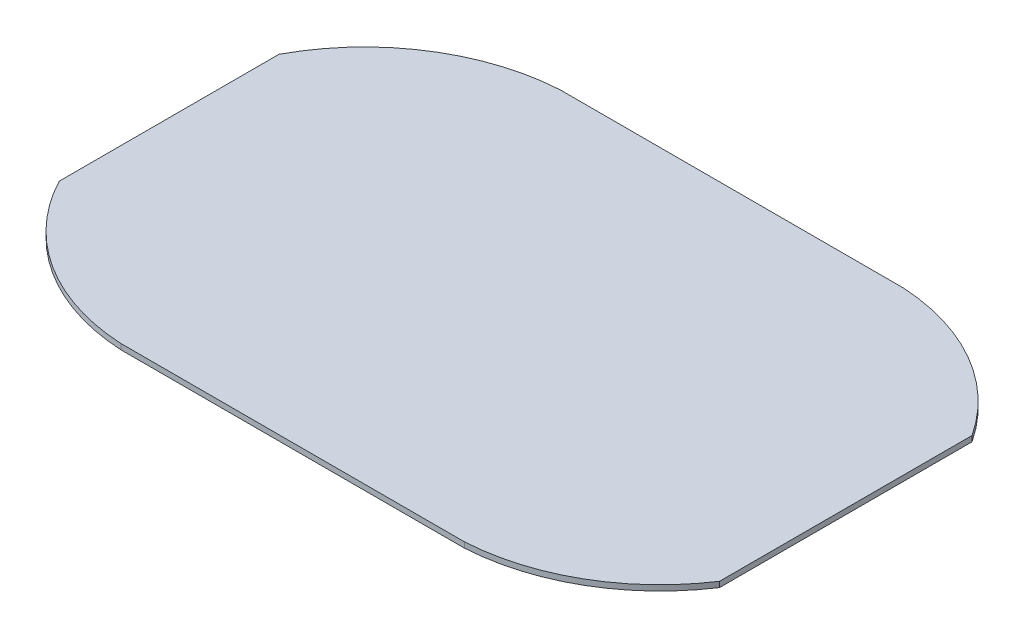
ISO-10303-21;
HEADER;
FILE_DESCRIPTION(('STEP AP214'),'2;1');
FILE_NAME('part.step','',(''),(''),'','','');
FILE_SCHEMA(('AUTOMOTIVE_DESIGN { 1 0 10303 214 1 1 1 1 }'));
ENDSEC;
DATA;
#1=APPLICATION_CONTEXT('core data for automotive mechanical design processes');
#2=APPLICATION_PROTOCOL_DEFINITION('international standard','automotive_design',2000,#1);
#3=PRODUCT_CONTEXT('',#1,'mechanical');
#4=PRODUCT('Part','Part','',(#3));
#5=PRODUCT_RELATED_PRODUCT_CATEGORY('part','',(#4));
#6=PRODUCT_DEFINITION_FORMATION('','',#4);
#7=PRODUCT_DEFINITION_CONTEXT('part definition',#1,'design');
#8=PRODUCT_DEFINITION('design','',#6,#7);
#9=PRODUCT_DEFINITION_SHAPE('','',#8);
#10=(LENGTH_UNIT() NAMED_UNIT(*) SI_UNIT(.MILLI.,.METRE.));
#11=(NAMED_UNIT(*) PLANE_ANGLE_UNIT() SI_UNIT($,.RADIAN.));
#12=(NAMED_UNIT(*) SI_UNIT($,.STERADIAN.) SOLID_ANGLE_UNIT());
#13=UNCERTAINTY_MEASURE_WITH_UNIT(LENGTH_MEASURE(1.E-05),#10,'distance_accuracy_value','');
#14=(GEOMETRIC_REPRESENTATION_CONTEXT(3) GLOBAL_UNCERTAINTY_ASSIGNED_CONTEXT((#13)) GLOBAL_UNIT_ASSIGNED_CONTEXT((#10,
#11,#12)) REPRESENTATION_CONTEXT('',''));
#15=CARTESIAN_POINT('',(0.,0.,0.));
#16=DIRECTION('',(0.,0.,1.));
#17=DIRECTION('',(1.,0.,0.));
#18=AXIS2_PLACEMENT_3D('',#15,#16,#17);
#19=CARTESIAN_POINT('',(-125.,2.,-80.));
#20=DIRECTION('',(0.,0.,1.));
#21=DIRECTION('',(1.,0.,0.));
#22=AXIS2_PLACEMENT_3D('',#19,#20,#21);
#23=PLANE('',#22);
#24=DIRECTION('',(-1.,0.,0.));
#25=VECTOR('',#24,1.);
#26=CARTESIAN_POINT('',(-125.,2.,-80.));
#27=LINE('',#26,#25);
#28=CARTESIAN_POINT('',(62.5,2.,-80.));
#29=VERTEX_POINT('',#28);
#30=CARTESIAN_POINT('',(-62.5,2.,-80.));
#31=VERTEX_POINT('',#30);
#32=EDGE_CURVE('E137',#29,#31,#27,.T.);
#33=ORIENTED_EDGE('',*,*,#32,.F.);
#34=DIRECTION('',(0.,1.,0.));
#35=VECTOR('',#34,1.);
#36=CARTESIAN_POINT('',(62.5,-48.,-80.));
#37=LINE('',#36,#35);
#38=CARTESIAN_POINT('',(62.5,0.,-80.));
#39=VERTEX_POINT('',#38);
#40=EDGE_CURVE('E116',#39,#29,#37,.T.);
#41=ORIENTED_EDGE('',*,*,#40,.F.);
#42=DIRECTION('',(-1.,0.,0.));
#43=VECTOR('',#42,1.);
#44=CARTESIAN_POINT('',(-125.,0.,-80.));
#45=LINE('',#44,#43);
#46=CARTESIAN_POINT('',(-62.5,0.,-80.));
#47=VERTEX_POINT('',#46);
#48=EDGE_CURVE('E136',#39,#47,#45,.T.);
#49=ORIENTED_EDGE('',*,*,#48,.T.);
#50=DIRECTION('',(0.,1.,0.));
#51=VECTOR('',#50,1.);
#52=CARTESIAN_POINT('',(-62.5,-48.,-80.));
#53=LINE('',#52,#51);
#54=EDGE_CURVE('E58',#47,#31,#53,.T.);
#55=ORIENTED_EDGE('',*,*,#54,.T.);
#56=EDGE_LOOP('',(#33,#41,#49,#55));
#57=FACE_BOUND('',#56,.T.);
#58=ADVANCED_FACE('F37',(#57),#23,.F.);
#59=CARTESIAN_POINT('',(-125.,2.,80.));
#60=DIRECTION('',(1.,0.,0.));
#61=DIRECTION('',(0.,0.,-1.));
#62=AXIS2_PLACEMENT_3D('',#59,#60,#61);
#63=PLANE('',#62);
#64=DIRECTION('',(0.,0.,1.));
#65=VECTOR('',#64,1.);
#66=CARTESIAN_POINT('',(-125.,0.,80.));
#67=LINE('',#66,#65);
#68=CARTESIAN_POINT('',(-125.,0.,-40.));
#69=VERTEX_POINT('',#68);
#70=CARTESIAN_POINT('',(-125.,0.,40.));
#71=VERTEX_POINT('',#70);
#72=EDGE_CURVE('E148',#69,#71,#67,.T.);
#73=ORIENTED_EDGE('',*,*,#72,.T.);
#74=DIRECTION('',(0.,1.,0.));
#75=VECTOR('',#74,1.);
#76=CARTESIAN_POINT('',(-125.,-48.,40.));
#77=LINE('',#76,#75);
#78=CARTESIAN_POINT('',(-125.,2.,40.));
#79=VERTEX_POINT('',#78);
#80=EDGE_CURVE('E124',#71,#79,#77,.T.);
#81=ORIENTED_EDGE('',*,*,#80,.T.);
#82=DIRECTION('',(0.,0.,1.));
#83=VECTOR('',#82,1.);
#84=CARTESIAN_POINT('',(-125.,2.,80.));
#85=LINE('',#84,#83);
#86=CARTESIAN_POINT('',(-125.,2.,-40.));
#87=VERTEX_POINT('',#86);
#88=EDGE_CURVE('E139',#87,#79,#85,.T.);
#89=ORIENTED_EDGE('',*,*,#88,.F.);
#90=DIRECTION('',(0.,1.,0.));
#91=VECTOR('',#90,1.);
#92=CARTESIAN_POINT('',(-125.,-48.,-40.));
#93=LINE('',#92,#91);
#94=EDGE_CURVE('E118',#69,#87,#93,.T.);
#95=ORIENTED_EDGE('',*,*,#94,.F.);
#96=EDGE_LOOP('',(#73,#81,#89,#95));
#97=FACE_BOUND('',#96,.T.);
#98=ADVANCED_FACE('F176',(#97),#63,.F.);
#99=CARTESIAN_POINT('',(-125.,2.,80.));
#100=DIRECTION('',(0.,0.,-1.));
#101=DIRECTION('',(-1.,0.,0.));
#102=AXIS2_PLACEMENT_3D('',#99,#100,#101);
#103=PLANE('',#102);
#104=DIRECTION('',(1.,0.,0.));
#105=VECTOR('',#104,1.);
#106=CARTESIAN_POINT('',(-125.,2.,80.));
#107=LINE('',#106,#105);
#108=CARTESIAN_POINT('',(-62.5,2.,80.));
#109=VERTEX_POINT('',#108);
#110=CARTESIAN_POINT('',(62.5,2.,80.));
#111=VERTEX_POINT('',#110);
#112=EDGE_CURVE('E143',#109,#111,#107,.T.);
#113=ORIENTED_EDGE('',*,*,#112,.F.);
#114=DIRECTION('',(0.,1.,0.));
#115=VECTOR('',#114,1.);
#116=CARTESIAN_POINT('',(-62.5,-48.,80.));
#117=LINE('',#116,#115);
#118=CARTESIAN_POINT('',(-62.5,0.,80.));
#119=VERTEX_POINT('',#118);
#120=EDGE_CURVE('E127',#119,#109,#117,.T.);
#121=ORIENTED_EDGE('',*,*,#120,.F.);
#122=DIRECTION('',(1.,0.,0.));
#123=VECTOR('',#122,1.);
#124=CARTESIAN_POINT('',(-125.,0.,80.));
#125=LINE('',#124,#123);
#126=CARTESIAN_POINT('',(62.4999999999999,0.,80.));
#127=VERTEX_POINT('',#126);
#128=EDGE_CURVE('E140',#119,#127,#125,.T.);
#129=ORIENTED_EDGE('',*,*,#128,.T.);
#130=DIRECTION('',(0.,1.,0.));
#131=VECTOR('',#130,1.);
#132=CARTESIAN_POINT('',(62.5,-48.,80.));
#133=LINE('',#132,#131);
#134=EDGE_CURVE('E132',#127,#111,#133,.T.);
#135=ORIENTED_EDGE('',*,*,#134,.T.);
#136=EDGE_LOOP('',(#113,#121,#129,#135));
#137=FACE_BOUND('',#136,.T.);
#138=ADVANCED_FACE('F168',(#137),#103,.F.);
#139=CARTESIAN_POINT('',(0.,2.,0.));
#140=DIRECTION('',(0.,-1.,0.));
#141=DIRECTION('',(0.,0.,-1.));
#142=AXIS2_PLACEMENT_3D('',#139,#140,#141);
#143=PLANE('',#142);
#144=CARTESIAN_POINT('',(58.1140833411923,2.,4.31888022061296));
#145=DIRECTION('',(0.,-1.,0.));
#146=DIRECTION('',(0.,0.,-1.));
#147=AXIS2_PLACEMENT_3D('',#144,#145,#146);
#148=CIRCLE('',#147,75.80810086);
#149=CARTESIAN_POINT('',(121.447872965525,2.,45.9806042346371));
#150=VERTEX_POINT('',#149);
#151=EDGE_CURVE('E112',#150,#111,#148,.T.);
#152=ORIENTED_EDGE('',*,*,#151,.F.);
#153=DIRECTION('',(0.,0.,1.));
#154=VECTOR('',#153,1.);
#155=CARTESIAN_POINT('',(121.447872965525,2.,-76.7820441304263));
#156=LINE('',#155,#154);
#157=CARTESIAN_POINT('',(121.447872965525,2.,-45.9806042346371));
#158=VERTEX_POINT('',#157);
#159=EDGE_CURVE('E99',#158,#150,#156,.T.);
#160=ORIENTED_EDGE('',*,*,#159,.F.);
#161=CARTESIAN_POINT('',(58.1140833411923,2.,-4.31888022061296));
#162=DIRECTION('',(0.,-1.,0.));
#163=DIRECTION('',(0.,0.,-1.));
#164=AXIS2_PLACEMENT_3D('',#161,#162,#163);
#165=CIRCLE('',#164,75.80810086);
#166=EDGE_CURVE('E109',#29,#158,#165,.T.);
#167=ORIENTED_EDGE('',*,*,#166,.F.);
#168=ORIENTED_EDGE('',*,*,#32,.T.);
#169=CARTESIAN_POINT('',(-58.1140832773658,2.,-4.31888012088417));
#170=DIRECTION('',(0.,-1.,0.));
#171=DIRECTION('',(0.,0.,1.));
#172=AXIS2_PLACEMENT_3D('',#169,#170,#171);
#173=CIRCLE('',#172,75.8081009632545);
#174=EDGE_CURVE('E133',#87,#31,#173,.T.);
#175=ORIENTED_EDGE('',*,*,#174,.F.);
#176=ORIENTED_EDGE('',*,*,#88,.T.);
#177=CARTESIAN_POINT('',(-58.8595262680034,2.,5.48363479375528));
#178=DIRECTION('',(0.,-1.,0.));
#179=DIRECTION('',(0.,0.,-1.));
#180=AXIS2_PLACEMENT_3D('',#177,#178,#179);
#181=CIRCLE('',#180,74.6052393102776);
#182=EDGE_CURVE('E120',#109,#79,#181,.T.);
#183=ORIENTED_EDGE('',*,*,#182,.F.);
#184=ORIENTED_EDGE('',*,*,#112,.T.);
#185=EDGE_LOOP('',(#152,#160,#167,#168,#175,#176,#183,#184));
#186=FACE_BOUND('',#185,.T.);
#187=ADVANCED_FACE('F107',(#186),#143,.F.);
#188=CARTESIAN_POINT('',(0.,0.,0.));
#189=DIRECTION('',(0.,-1.,0.));
#190=DIRECTION('',(0.,0.,-1.));
#191=AXIS2_PLACEMENT_3D('',#188,#189,#190);
#192=PLANE('',#191);
#193=DIRECTION('',(0.,0.,-1.));
#194=VECTOR('',#193,1.);
#195=CARTESIAN_POINT('',(121.447872965525,0.,0.));
#196=LINE('',#195,#194);
#197=CARTESIAN_POINT('',(121.447872965525,0.,45.9806042346371));
#198=VERTEX_POINT('',#197);
#199=CARTESIAN_POINT('',(121.447872965525,0.,-45.9806042346371));
#200=VERTEX_POINT('',#199);
#201=EDGE_CURVE('E51',#198,#200,#196,.T.);
#202=ORIENTED_EDGE('',*,*,#201,.F.);
#203=CARTESIAN_POINT('',(58.1140833411923,0.,4.31888022061296));
#204=DIRECTION('',(0.,-1.,0.));
#205=DIRECTION('',(0.,0.,-1.));
#206=AXIS2_PLACEMENT_3D('',#203,#204,#205);
#207=CIRCLE('',#206,75.80810086);
#208=EDGE_CURVE('E145',#127,#198,#207,.F.);
#209=ORIENTED_EDGE('',*,*,#208,.F.);
#210=ORIENTED_EDGE('',*,*,#128,.F.);
#211=CARTESIAN_POINT('',(-58.8595262680034,0.,5.48363479375528));
#212=DIRECTION('',(0.,-1.,0.));
#213=DIRECTION('',(0.,0.,-1.));
#214=AXIS2_PLACEMENT_3D('',#211,#212,#213);
#215=CIRCLE('',#214,74.6052393102776);
#216=EDGE_CURVE('E44',#71,#119,#215,.F.);
#217=ORIENTED_EDGE('',*,*,#216,.F.);
#218=ORIENTED_EDGE('',*,*,#72,.F.);
#219=CARTESIAN_POINT('',(-58.1140832773658,0.,-4.31888012088417));
#220=DIRECTION('',(0.,-1.,0.));
#221=DIRECTION('',(0.,0.,-1.));
#222=AXIS2_PLACEMENT_3D('',#219,#220,#221);
#223=CIRCLE('',#222,75.8081009632545);
#224=EDGE_CURVE('E155',#47,#69,#223,.F.);
#225=ORIENTED_EDGE('',*,*,#224,.F.);
#226=ORIENTED_EDGE('',*,*,#48,.F.);
#227=CARTESIAN_POINT('',(58.1140833411923,0.,-4.31888022061296));
#228=DIRECTION('',(0.,-1.,0.));
#229=DIRECTION('',(0.,0.,-1.));
#230=AXIS2_PLACEMENT_3D('',#227,#228,#229);
#231=CIRCLE('',#230,75.80810086);
#232=EDGE_CURVE('E157',#200,#39,#231,.F.);
#233=ORIENTED_EDGE('',*,*,#232,.F.);
#234=EDGE_LOOP('',(#202,#209,#210,#217,#218,#225,#226,#233));
#235=FACE_BOUND('',#234,.T.);
#236=ADVANCED_FACE('F170',(#235),#192,.T.);
#237=CARTESIAN_POINT('',(58.1140833411923,-48.,4.31888022061296));
#238=DIRECTION('',(0.,1.,0.));
#239=DIRECTION('',(0.,0.,1.));
#240=AXIS2_PLACEMENT_3D('',#237,#238,#239);
#241=CYLINDRICAL_SURFACE('',#240,75.80810086);
#242=ORIENTED_EDGE('',*,*,#208,.T.);
#243=DIRECTION('',(0.,1.,0.));
#244=VECTOR('',#243,1.);
#245=CARTESIAN_POINT('',(121.447872965525,-48.,45.9806042346371));
#246=LINE('',#245,#244);
#247=EDGE_CURVE('E129',#198,#150,#246,.T.);
#248=ORIENTED_EDGE('',*,*,#247,.T.);
#249=ORIENTED_EDGE('',*,*,#151,.T.);
#250=ORIENTED_EDGE('',*,*,#134,.F.);
#251=EDGE_LOOP('',(#242,#248,#249,#250));
#252=FACE_BOUND('',#251,.T.);
#253=ADVANCED_FACE('F172',(#252),#241,.T.);
#254=CARTESIAN_POINT('',(-58.1140832773658,-48.,-4.31888012088417));
#255=DIRECTION('',(0.,1.,0.));
#256=DIRECTION('',(0.,0.,1.));
#257=AXIS2_PLACEMENT_3D('',#254,#255,#256);
#258=CYLINDRICAL_SURFACE('',#257,75.8081009632545);
#259=ORIENTED_EDGE('',*,*,#224,.T.);
#260=ORIENTED_EDGE('',*,*,#94,.T.);
#261=ORIENTED_EDGE('',*,*,#174,.T.);
#262=ORIENTED_EDGE('',*,*,#54,.F.);
#263=EDGE_LOOP('',(#259,#260,#261,#262));
#264=FACE_BOUND('',#263,.T.);
#265=ADVANCED_FACE('F183',(#264),#258,.T.);
#266=CARTESIAN_POINT('',(58.1140833411923,-48.,-4.31888022061296));
#267=DIRECTION('',(0.,1.,0.));
#268=DIRECTION('',(0.,0.,1.));
#269=AXIS2_PLACEMENT_3D('',#266,#267,#268);
#270=CYLINDRICAL_SURFACE('',#269,75.80810086);
#271=ORIENTED_EDGE('',*,*,#166,.T.);
#272=DIRECTION('',(0.,1.,0.));
#273=VECTOR('',#272,1.);
#274=CARTESIAN_POINT('',(121.447872965525,-48.,-45.9806042346371));
#275=LINE('',#274,#273);
#276=EDGE_CURVE('E11',#158,#200,#275,.F.);
#277=ORIENTED_EDGE('',*,*,#276,.T.);
#278=ORIENTED_EDGE('',*,*,#232,.T.);
#279=ORIENTED_EDGE('',*,*,#40,.T.);
#280=EDGE_LOOP('',(#271,#277,#278,#279));
#281=FACE_BOUND('',#280,.T.);
#282=ADVANCED_FACE('F114',(#281),#270,.T.);
#283=CARTESIAN_POINT('',(-58.8595262680034,-48.,5.48363479375528));
#284=DIRECTION('',(0.,1.,0.));
#285=DIRECTION('',(0.,0.,1.));
#286=AXIS2_PLACEMENT_3D('',#283,#284,#285);
#287=CYLINDRICAL_SURFACE('',#286,74.6052393102776);
#288=ORIENTED_EDGE('',*,*,#216,.T.);
#289=ORIENTED_EDGE('',*,*,#120,.T.);
#290=ORIENTED_EDGE('',*,*,#182,.T.);
#291=ORIENTED_EDGE('',*,*,#80,.F.);
#292=EDGE_LOOP('',(#288,#289,#290,#291));
#293=FACE_BOUND('',#292,.T.);
#294=ADVANCED_FACE('F161',(#293),#287,.T.);
#295=CARTESIAN_POINT('',(121.447872965525,-48.,-76.7820441304263));
#296=DIRECTION('',(-1.,0.,0.));
#297=DIRECTION('',(0.,0.,1.));
#298=AXIS2_PLACEMENT_3D('',#295,#296,#297);
#299=PLANE('',#298);
#300=ORIENTED_EDGE('',*,*,#201,.T.);
#301=ORIENTED_EDGE('',*,*,#276,.F.);
#302=ORIENTED_EDGE('',*,*,#159,.T.);
#303=ORIENTED_EDGE('',*,*,#247,.F.);
#304=EDGE_LOOP('',(#300,#301,#302,#303));
#305=FACE_BOUND('',#304,.T.);
#306=ADVANCED_FACE('F98',(#305),#299,.F.);
#307=CLOSED_SHELL('',(#58,#98,#138,#187,#236,#253,#265,#282,#294,#306));
#308=MANIFOLD_SOLID_BREP('B2',#307);
#309=ADVANCED_BREP_SHAPE_REPRESENTATION('',(#18,#308),#14);
#310=SHAPE_DEFINITION_REPRESENTATION(#9,#309);
ENDSEC;
END-ISO-10303-21;
